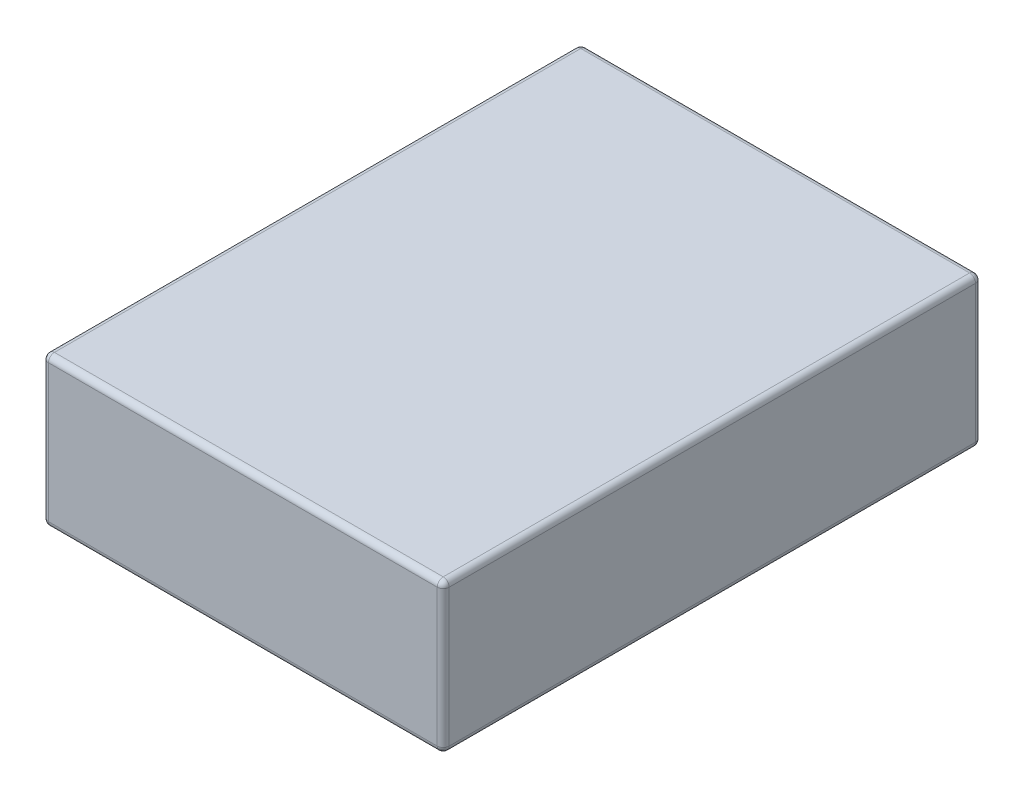
ISO-10303-21;
HEADER;
FILE_DESCRIPTION(('STEP AP214'),'2;1');
FILE_NAME('part.step','',(''),(''),'','','');
FILE_SCHEMA(('AUTOMOTIVE_DESIGN { 1 0 10303 214 1 1 1 1 }'));
ENDSEC;
DATA;
#1=APPLICATION_CONTEXT('core data for automotive mechanical design processes');
#2=APPLICATION_PROTOCOL_DEFINITION('international standard','automotive_design',2000,#1);
#3=PRODUCT_CONTEXT('',#1,'mechanical');
#4=PRODUCT('Part','Part','',(#3));
#5=PRODUCT_RELATED_PRODUCT_CATEGORY('part','',(#4));
#6=PRODUCT_DEFINITION_FORMATION('','',#4);
#7=PRODUCT_DEFINITION_CONTEXT('part definition',#1,'design');
#8=PRODUCT_DEFINITION('design','',#6,#7);
#9=PRODUCT_DEFINITION_SHAPE('','',#8);
#10=(LENGTH_UNIT() NAMED_UNIT(*) SI_UNIT(.MILLI.,.METRE.));
#11=(NAMED_UNIT(*) PLANE_ANGLE_UNIT() SI_UNIT($,.RADIAN.));
#12=(NAMED_UNIT(*) SI_UNIT($,.STERADIAN.) SOLID_ANGLE_UNIT());
#13=UNCERTAINTY_MEASURE_WITH_UNIT(LENGTH_MEASURE(1.E-05),#10,'distance_accuracy_value','');
#14=(GEOMETRIC_REPRESENTATION_CONTEXT(3) GLOBAL_UNCERTAINTY_ASSIGNED_CONTEXT((#13)) GLOBAL_UNIT_ASSIGNED_CONTEXT((#10,
#11,#12)) REPRESENTATION_CONTEXT('',''));
#15=CARTESIAN_POINT('',(0.,0.,0.));
#16=DIRECTION('',(0.,0.,1.));
#17=DIRECTION('',(1.,0.,0.));
#18=AXIS2_PLACEMENT_3D('',#15,#16,#17);
#19=CARTESIAN_POINT('',(33.5,25.,45.));
#20=DIRECTION('',(-1.,0.,0.));
#21=DIRECTION('',(0.,0.,1.));
#22=AXIS2_PLACEMENT_3D('',#19,#20,#21);
#23=PLANE('',#22);
#24=DIRECTION('',(0.,0.,-1.));
#25=VECTOR('',#24,1.);
#26=CARTESIAN_POINT('',(33.5,1.,-45.));
#27=LINE('',#26,#25);
#28=CARTESIAN_POINT('',(33.5,1.,44.));
#29=VERTEX_POINT('',#28);
#30=CARTESIAN_POINT('',(33.5,1.,-44.));
#31=VERTEX_POINT('',#30);
#32=EDGE_CURVE('E245',#29,#31,#27,.T.);
#33=ORIENTED_EDGE('',*,*,#32,.T.);
#34=DIRECTION('',(0.,-1.,0.));
#35=VECTOR('',#34,1.);
#36=CARTESIAN_POINT('',(33.5,25.,-44.));
#37=LINE('',#36,#35);
#38=CARTESIAN_POINT('',(33.5,24.,-44.));
#39=VERTEX_POINT('',#38);
#40=EDGE_CURVE('E240',#31,#39,#37,.F.);
#41=ORIENTED_EDGE('',*,*,#40,.T.);
#42=DIRECTION('',(0.,0.,-1.));
#43=VECTOR('',#42,1.);
#44=CARTESIAN_POINT('',(33.5,24.,45.));
#45=LINE('',#44,#43);
#46=CARTESIAN_POINT('',(33.5,24.,44.));
#47=VERTEX_POINT('',#46);
#48=EDGE_CURVE('E236',#39,#47,#45,.F.);
#49=ORIENTED_EDGE('',*,*,#48,.T.);
#50=DIRECTION('',(0.,-1.,0.));
#51=VECTOR('',#50,1.);
#52=CARTESIAN_POINT('',(33.5,25.,44.));
#53=LINE('',#52,#51);
#54=EDGE_CURVE('E241',#47,#29,#53,.T.);
#55=ORIENTED_EDGE('',*,*,#54,.T.);
#56=EDGE_LOOP('',(#33,#41,#49,#55));
#57=FACE_BOUND('',#56,.T.);
#58=ADVANCED_FACE('F39',(#57),#23,.F.);
#59=CARTESIAN_POINT('',(-33.5,25.,-45.));
#60=DIRECTION('',(0.,0.,1.));
#61=DIRECTION('',(1.,0.,0.));
#62=AXIS2_PLACEMENT_3D('',#59,#60,#61);
#63=PLANE('',#62);
#64=DIRECTION('',(0.,-1.,0.));
#65=VECTOR('',#64,1.);
#66=CARTESIAN_POINT('',(32.5,25.,-45.));
#67=LINE('',#66,#65);
#68=CARTESIAN_POINT('',(32.5,24.,-45.));
#69=VERTEX_POINT('',#68);
#70=CARTESIAN_POINT('',(32.5,1.,-45.));
#71=VERTEX_POINT('',#70);
#72=EDGE_CURVE('E323',#69,#71,#67,.T.);
#73=ORIENTED_EDGE('',*,*,#72,.T.);
#74=DIRECTION('',(-1.,0.,0.));
#75=VECTOR('',#74,1.);
#76=CARTESIAN_POINT('',(-33.5,1.,-45.));
#77=LINE('',#76,#75);
#78=CARTESIAN_POINT('',(-32.5,1.,-45.));
#79=VERTEX_POINT('',#78);
#80=EDGE_CURVE('E326',#71,#79,#77,.T.);
#81=ORIENTED_EDGE('',*,*,#80,.T.);
#82=DIRECTION('',(0.,-1.,0.));
#83=VECTOR('',#82,1.);
#84=CARTESIAN_POINT('',(-32.5,25.,-45.));
#85=LINE('',#84,#83);
#86=CARTESIAN_POINT('',(-32.5,24.,-45.));
#87=VERTEX_POINT('',#86);
#88=EDGE_CURVE('E317',#79,#87,#85,.F.);
#89=ORIENTED_EDGE('',*,*,#88,.T.);
#90=DIRECTION('',(-1.,0.,0.));
#91=VECTOR('',#90,1.);
#92=CARTESIAN_POINT('',(-33.5,24.,-45.));
#93=LINE('',#92,#91);
#94=EDGE_CURVE('E314',#87,#69,#93,.F.);
#95=ORIENTED_EDGE('',*,*,#94,.T.);
#96=EDGE_LOOP('',(#73,#81,#89,#95));
#97=FACE_BOUND('',#96,.T.);
#98=ADVANCED_FACE('F359',(#97),#63,.F.);
#99=CARTESIAN_POINT('',(-33.5,25.,45.));
#100=DIRECTION('',(1.,0.,0.));
#101=DIRECTION('',(0.,0.,-1.));
#102=AXIS2_PLACEMENT_3D('',#99,#100,#101);
#103=PLANE('',#102);
#104=DIRECTION('',(0.,-1.,0.));
#105=VECTOR('',#104,1.);
#106=CARTESIAN_POINT('',(-33.5,25.,-44.));
#107=LINE('',#106,#105);
#108=CARTESIAN_POINT('',(-33.5,24.,-44.));
#109=VERTEX_POINT('',#108);
#110=CARTESIAN_POINT('',(-33.5,1.,-44.));
#111=VERTEX_POINT('',#110);
#112=EDGE_CURVE('E139',#109,#111,#107,.T.);
#113=ORIENTED_EDGE('',*,*,#112,.T.);
#114=DIRECTION('',(0.,0.,1.));
#115=VECTOR('',#114,1.);
#116=CARTESIAN_POINT('',(-33.5,1.,45.));
#117=LINE('',#116,#115);
#118=CARTESIAN_POINT('',(-33.5,1.,44.));
#119=VERTEX_POINT('',#118);
#120=EDGE_CURVE('E134',#111,#119,#117,.T.);
#121=ORIENTED_EDGE('',*,*,#120,.T.);
#122=DIRECTION('',(0.,-1.,0.));
#123=VECTOR('',#122,1.);
#124=CARTESIAN_POINT('',(-33.5,25.,44.));
#125=LINE('',#124,#123);
#126=CARTESIAN_POINT('',(-33.5,24.,44.));
#127=VERTEX_POINT('',#126);
#128=EDGE_CURVE('E128',#119,#127,#125,.F.);
#129=ORIENTED_EDGE('',*,*,#128,.T.);
#130=DIRECTION('',(0.,0.,1.));
#131=VECTOR('',#130,1.);
#132=CARTESIAN_POINT('',(-33.5,24.,45.));
#133=LINE('',#132,#131);
#134=EDGE_CURVE('E131',#127,#109,#133,.F.);
#135=ORIENTED_EDGE('',*,*,#134,.T.);
#136=EDGE_LOOP('',(#113,#121,#129,#135));
#137=FACE_BOUND('',#136,.T.);
#138=ADVANCED_FACE('F130',(#137),#103,.F.);
#139=CARTESIAN_POINT('',(-33.5,25.,45.));
#140=DIRECTION('',(0.,0.,-1.));
#141=DIRECTION('',(-1.,0.,0.));
#142=AXIS2_PLACEMENT_3D('',#139,#140,#141);
#143=PLANE('',#142);
#144=DIRECTION('',(1.,0.,0.));
#145=VECTOR('',#144,1.);
#146=CARTESIAN_POINT('',(-33.5,24.,45.));
#147=LINE('',#146,#145);
#148=CARTESIAN_POINT('',(32.5,24.,45.));
#149=VERTEX_POINT('',#148);
#150=CARTESIAN_POINT('',(-32.5,24.,45.));
#151=VERTEX_POINT('',#150);
#152=EDGE_CURVE('E259',#149,#151,#147,.F.);
#153=ORIENTED_EDGE('',*,*,#152,.T.);
#154=DIRECTION('',(0.,-1.,0.));
#155=VECTOR('',#154,1.);
#156=CARTESIAN_POINT('',(-32.5,25.,45.));
#157=LINE('',#156,#155);
#158=CARTESIAN_POINT('',(-32.5,1.,45.));
#159=VERTEX_POINT('',#158);
#160=EDGE_CURVE('E163',#151,#159,#157,.T.);
#161=ORIENTED_EDGE('',*,*,#160,.T.);
#162=DIRECTION('',(1.,0.,0.));
#163=VECTOR('',#162,1.);
#164=CARTESIAN_POINT('',(33.5,1.,45.));
#165=LINE('',#164,#163);
#166=CARTESIAN_POINT('',(32.5,1.,45.));
#167=VERTEX_POINT('',#166);
#168=EDGE_CURVE('E250',#159,#167,#165,.T.);
#169=ORIENTED_EDGE('',*,*,#168,.T.);
#170=DIRECTION('',(0.,-1.,0.));
#171=VECTOR('',#170,1.);
#172=CARTESIAN_POINT('',(32.5,25.,45.));
#173=LINE('',#172,#171);
#174=EDGE_CURVE('E253',#167,#149,#173,.F.);
#175=ORIENTED_EDGE('',*,*,#174,.T.);
#176=EDGE_LOOP('',(#153,#161,#169,#175));
#177=FACE_BOUND('',#176,.T.);
#178=ADVANCED_FACE('F543',(#177),#143,.F.);
#179=CARTESIAN_POINT('',(0.,25.,0.));
#180=DIRECTION('',(0.,-1.,0.));
#181=DIRECTION('',(0.,0.,-1.));
#182=AXIS2_PLACEMENT_3D('',#179,#180,#181);
#183=PLANE('',#182);
#184=DIRECTION('',(1.,0.,0.));
#185=VECTOR('',#184,1.);
#186=CARTESIAN_POINT('',(0.,25.,44.));
#187=LINE('',#186,#185);
#188=CARTESIAN_POINT('',(-32.5,25.,44.));
#189=VERTEX_POINT('',#188);
#190=CARTESIAN_POINT('',(32.5,25.,44.));
#191=VERTEX_POINT('',#190);
#192=EDGE_CURVE('E49',#189,#191,#187,.T.);
#193=ORIENTED_EDGE('',*,*,#192,.T.);
#194=DIRECTION('',(0.,0.,-1.));
#195=VECTOR('',#194,1.);
#196=CARTESIAN_POINT('',(32.5,25.,0.));
#197=LINE('',#196,#195);
#198=CARTESIAN_POINT('',(32.5,25.,-44.));
#199=VERTEX_POINT('',#198);
#200=EDGE_CURVE('E11',#191,#199,#197,.T.);
#201=ORIENTED_EDGE('',*,*,#200,.T.);
#202=DIRECTION('',(-1.,0.,0.));
#203=VECTOR('',#202,1.);
#204=CARTESIAN_POINT('',(0.,25.,-44.));
#205=LINE('',#204,#203);
#206=CARTESIAN_POINT('',(-32.5,25.,-44.));
#207=VERTEX_POINT('',#206);
#208=EDGE_CURVE('E264',#199,#207,#205,.T.);
#209=ORIENTED_EDGE('',*,*,#208,.T.);
#210=DIRECTION('',(0.,0.,1.));
#211=VECTOR('',#210,1.);
#212=CARTESIAN_POINT('',(-32.5,25.,0.));
#213=LINE('',#212,#211);
#214=EDGE_CURVE('E60',#207,#189,#213,.T.);
#215=ORIENTED_EDGE('',*,*,#214,.T.);
#216=EDGE_LOOP('',(#193,#201,#209,#215));
#217=FACE_BOUND('',#216,.T.);
#218=ADVANCED_FACE('F535',(#217),#183,.F.);
#219=CARTESIAN_POINT('',(0.,0.,0.));
#220=DIRECTION('',(0.,-1.,0.));
#221=DIRECTION('',(0.,0.,-1.));
#222=AXIS2_PLACEMENT_3D('',#219,#220,#221);
#223=PLANE('',#222);
#224=DIRECTION('',(1.,0.,0.));
#225=VECTOR('',#224,1.);
#226=CARTESIAN_POINT('',(-33.5,0.,44.));
#227=LINE('',#226,#225);
#228=CARTESIAN_POINT('',(32.5,0.,44.));
#229=VERTEX_POINT('',#228);
#230=CARTESIAN_POINT('',(-32.5,0.,44.));
#231=VERTEX_POINT('',#230);
#232=EDGE_CURVE('E305',#229,#231,#227,.F.);
#233=ORIENTED_EDGE('',*,*,#232,.T.);
#234=DIRECTION('',(0.,0.,1.));
#235=VECTOR('',#234,1.);
#236=CARTESIAN_POINT('',(-32.5,0.,-45.));
#237=LINE('',#236,#235);
#238=CARTESIAN_POINT('',(-32.5,0.,-44.));
#239=VERTEX_POINT('',#238);
#240=EDGE_CURVE('E304',#231,#239,#237,.F.);
#241=ORIENTED_EDGE('',*,*,#240,.T.);
#242=DIRECTION('',(-1.,0.,0.));
#243=VECTOR('',#242,1.);
#244=CARTESIAN_POINT('',(33.5,0.,-44.));
#245=LINE('',#244,#243);
#246=CARTESIAN_POINT('',(32.5,0.,-44.));
#247=VERTEX_POINT('',#246);
#248=EDGE_CURVE('E297',#239,#247,#245,.F.);
#249=ORIENTED_EDGE('',*,*,#248,.T.);
#250=DIRECTION('',(0.,0.,-1.));
#251=VECTOR('',#250,1.);
#252=CARTESIAN_POINT('',(32.5,0.,45.));
#253=LINE('',#252,#251);
#254=EDGE_CURVE('E347',#247,#229,#253,.F.);
#255=ORIENTED_EDGE('',*,*,#254,.T.);
#256=EDGE_LOOP('',(#233,#241,#249,#255));
#257=FACE_BOUND('',#256,.T.);
#258=ADVANCED_FACE('F308',(#257),#223,.T.);
#259=CARTESIAN_POINT('',(32.5,24.,0.));
#260=DIRECTION('',(0.,0.,-1.));
#261=DIRECTION('',(-1.,0.,0.));
#262=AXIS2_PLACEMENT_3D('',#259,#260,#261);
#263=CYLINDRICAL_SURFACE('',#262,1.);
#264=CARTESIAN_POINT('',(32.5,24.,-44.));
#265=DIRECTION('',(0.,0.,-1.));
#266=DIRECTION('',(-1.,0.,0.));
#267=AXIS2_PLACEMENT_3D('',#264,#265,#266);
#268=CIRCLE('',#267,1.);
#269=EDGE_CURVE('E43',#199,#39,#268,.T.);
#270=ORIENTED_EDGE('',*,*,#269,.F.);
#271=ORIENTED_EDGE('',*,*,#200,.F.);
#272=CARTESIAN_POINT('',(32.5,24.,44.));
#273=DIRECTION('',(0.,0.,1.));
#274=DIRECTION('',(1.,0.,0.));
#275=AXIS2_PLACEMENT_3D('',#272,#273,#274);
#276=CIRCLE('',#275,1.);
#277=EDGE_CURVE('E219',#47,#191,#276,.T.);
#278=ORIENTED_EDGE('',*,*,#277,.F.);
#279=ORIENTED_EDGE('',*,*,#48,.F.);
#280=EDGE_LOOP('',(#270,#271,#278,#279));
#281=FACE_BOUND('',#280,.T.);
#282=ADVANCED_FACE('F41',(#281),#263,.T.);
#283=CARTESIAN_POINT('',(32.5,24.,-44.));
#284=DIRECTION('',(0.,0.,1.));
#285=DIRECTION('',(1.,0.,0.));
#286=AXIS2_PLACEMENT_3D('',#283,#284,#285);
#287=SPHERICAL_SURFACE('',#286,1.);
#288=CARTESIAN_POINT('',(32.5,24.,-44.));
#289=DIRECTION('',(1.,0.,0.));
#290=DIRECTION('',(0.,0.,-1.));
#291=AXIS2_PLACEMENT_3D('',#288,#289,#290);
#292=CIRCLE('',#291,1.);
#293=EDGE_CURVE('E213',#199,#69,#292,.F.);
#294=ORIENTED_EDGE('',*,*,#293,.F.);
#295=ORIENTED_EDGE('',*,*,#269,.T.);
#296=CARTESIAN_POINT('',(32.5,24.,-44.));
#297=DIRECTION('',(0.,1.,0.));
#298=DIRECTION('',(0.,0.,1.));
#299=AXIS2_PLACEMENT_3D('',#296,#297,#298);
#300=CIRCLE('',#299,1.);
#301=EDGE_CURVE('E217',#69,#39,#300,.F.);
#302=ORIENTED_EDGE('',*,*,#301,.F.);
#303=EDGE_LOOP('',(#294,#295,#302));
#304=FACE_BOUND('',#303,.T.);
#305=ADVANCED_FACE('F233',(#304),#287,.T.);
#306=CARTESIAN_POINT('',(32.5,24.,44.));
#307=DIRECTION('',(0.,0.,1.));
#308=DIRECTION('',(1.,0.,0.));
#309=AXIS2_PLACEMENT_3D('',#306,#307,#308);
#310=SPHERICAL_SURFACE('',#309,1.);
#311=CARTESIAN_POINT('',(32.5,24.,44.));
#312=DIRECTION('',(0.,1.,0.));
#313=DIRECTION('',(0.,0.,1.));
#314=AXIS2_PLACEMENT_3D('',#311,#312,#313);
#315=CIRCLE('',#314,1.);
#316=EDGE_CURVE('E205',#47,#149,#315,.F.);
#317=ORIENTED_EDGE('',*,*,#316,.F.);
#318=ORIENTED_EDGE('',*,*,#277,.T.);
#319=CARTESIAN_POINT('',(32.5,24.,44.));
#320=DIRECTION('',(1.,0.,0.));
#321=DIRECTION('',(0.,0.,-1.));
#322=AXIS2_PLACEMENT_3D('',#319,#320,#321);
#323=CIRCLE('',#322,1.);
#324=EDGE_CURVE('E209',#149,#191,#323,.F.);
#325=ORIENTED_EDGE('',*,*,#324,.F.);
#326=EDGE_LOOP('',(#317,#318,#325));
#327=FACE_BOUND('',#326,.T.);
#328=ADVANCED_FACE('F508',(#327),#310,.T.);
#329=CARTESIAN_POINT('',(32.5,25.,-44.));
#330=DIRECTION('',(0.,-1.,0.));
#331=DIRECTION('',(0.,0.,-1.));
#332=AXIS2_PLACEMENT_3D('',#329,#330,#331);
#333=CYLINDRICAL_SURFACE('',#332,1.);
#334=ORIENTED_EDGE('',*,*,#301,.T.);
#335=ORIENTED_EDGE('',*,*,#40,.F.);
#336=CARTESIAN_POINT('',(32.5,1.,-44.));
#337=DIRECTION('',(0.,-1.,0.));
#338=DIRECTION('',(0.,0.,-1.));
#339=AXIS2_PLACEMENT_3D('',#336,#337,#338);
#340=CIRCLE('',#339,1.);
#341=EDGE_CURVE('E197',#71,#31,#340,.T.);
#342=ORIENTED_EDGE('',*,*,#341,.F.);
#343=ORIENTED_EDGE('',*,*,#72,.F.);
#344=EDGE_LOOP('',(#334,#335,#342,#343));
#345=FACE_BOUND('',#344,.T.);
#346=ADVANCED_FACE('F360',(#345),#333,.T.);
#347=CARTESIAN_POINT('',(0.,24.,-44.));
#348=DIRECTION('',(-1.,0.,0.));
#349=DIRECTION('',(0.,0.,1.));
#350=AXIS2_PLACEMENT_3D('',#347,#348,#349);
#351=CYLINDRICAL_SURFACE('',#350,1.);
#352=ORIENTED_EDGE('',*,*,#293,.T.);
#353=ORIENTED_EDGE('',*,*,#94,.F.);
#354=CARTESIAN_POINT('',(-32.5,24.,-44.));
#355=DIRECTION('',(-1.,0.,0.));
#356=DIRECTION('',(0.,0.,1.));
#357=AXIS2_PLACEMENT_3D('',#354,#355,#356);
#358=CIRCLE('',#357,1.);
#359=EDGE_CURVE('E193',#207,#87,#358,.T.);
#360=ORIENTED_EDGE('',*,*,#359,.F.);
#361=ORIENTED_EDGE('',*,*,#208,.F.);
#362=EDGE_LOOP('',(#352,#353,#360,#361));
#363=FACE_BOUND('',#362,.T.);
#364=ADVANCED_FACE('F492',(#363),#351,.T.);
#365=CARTESIAN_POINT('',(-32.5,24.,0.));
#366=DIRECTION('',(0.,0.,1.));
#367=DIRECTION('',(1.,0.,0.));
#368=AXIS2_PLACEMENT_3D('',#365,#366,#367);
#369=CYLINDRICAL_SURFACE('',#368,1.);
#370=CARTESIAN_POINT('',(-32.5,24.,44.));
#371=DIRECTION('',(0.,0.,1.));
#372=DIRECTION('',(1.,0.,0.));
#373=AXIS2_PLACEMENT_3D('',#370,#371,#372);
#374=CIRCLE('',#373,1.);
#375=EDGE_CURVE('E145',#189,#127,#374,.T.);
#376=ORIENTED_EDGE('',*,*,#375,.F.);
#377=ORIENTED_EDGE('',*,*,#214,.F.);
#378=CARTESIAN_POINT('',(-32.5,24.,-44.));
#379=DIRECTION('',(0.,0.,-1.));
#380=DIRECTION('',(-1.,0.,0.));
#381=AXIS2_PLACEMENT_3D('',#378,#379,#380);
#382=CIRCLE('',#381,1.);
#383=EDGE_CURVE('E148',#109,#207,#382,.T.);
#384=ORIENTED_EDGE('',*,*,#383,.F.);
#385=ORIENTED_EDGE('',*,*,#134,.F.);
#386=EDGE_LOOP('',(#376,#377,#384,#385));
#387=FACE_BOUND('',#386,.T.);
#388=ADVANCED_FACE('F144',(#387),#369,.T.);
#389=CARTESIAN_POINT('',(0.,24.,44.));
#390=DIRECTION('',(1.,0.,0.));
#391=DIRECTION('',(0.,0.,-1.));
#392=AXIS2_PLACEMENT_3D('',#389,#390,#391);
#393=CYLINDRICAL_SURFACE('',#392,1.);
#394=ORIENTED_EDGE('',*,*,#324,.T.);
#395=ORIENTED_EDGE('',*,*,#192,.F.);
#396=CARTESIAN_POINT('',(-32.5,24.,44.));
#397=DIRECTION('',(-1.,0.,0.));
#398=DIRECTION('',(0.,0.,1.));
#399=AXIS2_PLACEMENT_3D('',#396,#397,#398);
#400=CIRCLE('',#399,1.);
#401=EDGE_CURVE('E158',#151,#189,#400,.T.);
#402=ORIENTED_EDGE('',*,*,#401,.F.);
#403=ORIENTED_EDGE('',*,*,#152,.F.);
#404=EDGE_LOOP('',(#394,#395,#402,#403));
#405=FACE_BOUND('',#404,.T.);
#406=ADVANCED_FACE('F476',(#405),#393,.T.);
#407=CARTESIAN_POINT('',(32.5,25.,44.));
#408=DIRECTION('',(0.,-1.,0.));
#409=DIRECTION('',(0.,0.,-1.));
#410=AXIS2_PLACEMENT_3D('',#407,#408,#409);
#411=CYLINDRICAL_SURFACE('',#410,1.);
#412=ORIENTED_EDGE('',*,*,#316,.T.);
#413=ORIENTED_EDGE('',*,*,#174,.F.);
#414=CARTESIAN_POINT('',(32.5,1.,44.));
#415=DIRECTION('',(0.,-1.,0.));
#416=DIRECTION('',(0.,0.,-1.));
#417=AXIS2_PLACEMENT_3D('',#414,#415,#416);
#418=CIRCLE('',#417,1.);
#419=EDGE_CURVE('E185',#29,#167,#418,.T.);
#420=ORIENTED_EDGE('',*,*,#419,.F.);
#421=ORIENTED_EDGE('',*,*,#54,.F.);
#422=EDGE_LOOP('',(#412,#413,#420,#421));
#423=FACE_BOUND('',#422,.T.);
#424=ADVANCED_FACE('F340',(#423),#411,.T.);
#425=CARTESIAN_POINT('',(32.5,1.,45.));
#426=DIRECTION('',(0.,0.,1.));
#427=DIRECTION('',(1.,0.,0.));
#428=AXIS2_PLACEMENT_3D('',#425,#426,#427);
#429=CYLINDRICAL_SURFACE('',#428,1.);
#430=CARTESIAN_POINT('',(32.5,1.,-44.));
#431=DIRECTION('',(0.,0.,-1.));
#432=DIRECTION('',(-1.,0.,0.));
#433=AXIS2_PLACEMENT_3D('',#430,#431,#432);
#434=CIRCLE('',#433,1.);
#435=EDGE_CURVE('E201',#31,#247,#434,.T.);
#436=ORIENTED_EDGE('',*,*,#435,.F.);
#437=ORIENTED_EDGE('',*,*,#32,.F.);
#438=CARTESIAN_POINT('',(32.5,1.,44.));
#439=DIRECTION('',(0.,0.,1.));
#440=DIRECTION('',(1.,0.,0.));
#441=AXIS2_PLACEMENT_3D('',#438,#439,#440);
#442=CIRCLE('',#441,1.);
#443=EDGE_CURVE('E181',#229,#29,#442,.T.);
#444=ORIENTED_EDGE('',*,*,#443,.F.);
#445=ORIENTED_EDGE('',*,*,#254,.F.);
#446=EDGE_LOOP('',(#436,#437,#444,#445));
#447=FACE_BOUND('',#446,.T.);
#448=ADVANCED_FACE('F337',(#447),#429,.T.);
#449=CARTESIAN_POINT('',(32.5,1.,-44.));
#450=DIRECTION('',(0.,0.,1.));
#451=DIRECTION('',(1.,0.,0.));
#452=AXIS2_PLACEMENT_3D('',#449,#450,#451);
#453=SPHERICAL_SURFACE('',#452,1.);
#454=ORIENTED_EDGE('',*,*,#341,.T.);
#455=ORIENTED_EDGE('',*,*,#435,.T.);
#456=CARTESIAN_POINT('',(32.5,1.,-44.));
#457=DIRECTION('',(1.,0.,0.));
#458=DIRECTION('',(0.,0.,-1.));
#459=AXIS2_PLACEMENT_3D('',#456,#457,#458);
#460=CIRCLE('',#459,1.);
#461=EDGE_CURVE('E171',#71,#247,#460,.F.);
#462=ORIENTED_EDGE('',*,*,#461,.F.);
#463=EDGE_LOOP('',(#454,#455,#462));
#464=FACE_BOUND('',#463,.T.);
#465=ADVANCED_FACE('F362',(#464),#453,.T.);
#466=CARTESIAN_POINT('',(-32.5,24.,-44.));
#467=DIRECTION('',(0.,0.,1.));
#468=DIRECTION('',(1.,0.,0.));
#469=AXIS2_PLACEMENT_3D('',#466,#467,#468);
#470=SPHERICAL_SURFACE('',#469,1.);
#471=ORIENTED_EDGE('',*,*,#383,.T.);
#472=ORIENTED_EDGE('',*,*,#359,.T.);
#473=CARTESIAN_POINT('',(-32.5,24.,-44.));
#474=DIRECTION('',(0.,1.,0.));
#475=DIRECTION('',(0.,0.,1.));
#476=AXIS2_PLACEMENT_3D('',#473,#474,#475);
#477=CIRCLE('',#476,1.);
#478=EDGE_CURVE('E165',#109,#87,#477,.F.);
#479=ORIENTED_EDGE('',*,*,#478,.F.);
#480=EDGE_LOOP('',(#471,#472,#479));
#481=FACE_BOUND('',#480,.T.);
#482=ADVANCED_FACE('F364',(#481),#470,.T.);
#483=CARTESIAN_POINT('',(-32.5,24.,44.));
#484=DIRECTION('',(0.,0.,1.));
#485=DIRECTION('',(1.,0.,0.));
#486=AXIS2_PLACEMENT_3D('',#483,#484,#485);
#487=SPHERICAL_SURFACE('',#486,1.);
#488=ORIENTED_EDGE('',*,*,#401,.T.);
#489=ORIENTED_EDGE('',*,*,#375,.T.);
#490=CARTESIAN_POINT('',(-32.5,24.,44.));
#491=DIRECTION('',(0.,1.,0.));
#492=DIRECTION('',(0.,0.,1.));
#493=AXIS2_PLACEMENT_3D('',#490,#491,#492);
#494=CIRCLE('',#493,1.);
#495=EDGE_CURVE('E155',#151,#127,#494,.F.);
#496=ORIENTED_EDGE('',*,*,#495,.F.);
#497=EDGE_LOOP('',(#488,#489,#496));
#498=FACE_BOUND('',#497,.T.);
#499=ADVANCED_FACE('F154',(#498),#487,.T.);
#500=CARTESIAN_POINT('',(32.5,1.,44.));
#501=DIRECTION('',(0.,0.,1.));
#502=DIRECTION('',(1.,0.,0.));
#503=AXIS2_PLACEMENT_3D('',#500,#501,#502);
#504=SPHERICAL_SURFACE('',#503,1.);
#505=ORIENTED_EDGE('',*,*,#443,.T.);
#506=ORIENTED_EDGE('',*,*,#419,.T.);
#507=CARTESIAN_POINT('',(32.5,1.,44.));
#508=DIRECTION('',(1.,0.,0.));
#509=DIRECTION('',(0.,0.,-1.));
#510=AXIS2_PLACEMENT_3D('',#507,#508,#509);
#511=CIRCLE('',#510,1.);
#512=EDGE_CURVE('E166',#229,#167,#511,.F.);
#513=ORIENTED_EDGE('',*,*,#512,.F.);
#514=EDGE_LOOP('',(#505,#506,#513));
#515=FACE_BOUND('',#514,.T.);
#516=ADVANCED_FACE('F342',(#515),#504,.T.);
#517=CARTESIAN_POINT('',(-33.5,1.,-44.));
#518=DIRECTION('',(1.,0.,0.));
#519=DIRECTION('',(0.,0.,-1.));
#520=AXIS2_PLACEMENT_3D('',#517,#518,#519);
#521=CYLINDRICAL_SURFACE('',#520,1.);
#522=ORIENTED_EDGE('',*,*,#461,.T.);
#523=ORIENTED_EDGE('',*,*,#248,.F.);
#524=CARTESIAN_POINT('',(-32.5,1.,-44.));
#525=DIRECTION('',(-1.,0.,0.));
#526=DIRECTION('',(0.,0.,1.));
#527=AXIS2_PLACEMENT_3D('',#524,#525,#526);
#528=CIRCLE('',#527,1.);
#529=EDGE_CURVE('E174',#79,#239,#528,.T.);
#530=ORIENTED_EDGE('',*,*,#529,.F.);
#531=ORIENTED_EDGE('',*,*,#80,.F.);
#532=EDGE_LOOP('',(#522,#523,#530,#531));
#533=FACE_BOUND('',#532,.T.);
#534=ADVANCED_FACE('F299',(#533),#521,.T.);
#535=CARTESIAN_POINT('',(-32.5,25.,-44.));
#536=DIRECTION('',(0.,-1.,0.));
#537=DIRECTION('',(0.,0.,-1.));
#538=AXIS2_PLACEMENT_3D('',#535,#536,#537);
#539=CYLINDRICAL_SURFACE('',#538,1.);
#540=ORIENTED_EDGE('',*,*,#478,.T.);
#541=ORIENTED_EDGE('',*,*,#88,.F.);
#542=CARTESIAN_POINT('',(-32.5,1.,-44.));
#543=DIRECTION('',(0.,-1.,0.));
#544=DIRECTION('',(0.,0.,-1.));
#545=AXIS2_PLACEMENT_3D('',#542,#543,#544);
#546=CIRCLE('',#545,1.);
#547=EDGE_CURVE('E284',#111,#79,#546,.T.);
#548=ORIENTED_EDGE('',*,*,#547,.F.);
#549=ORIENTED_EDGE('',*,*,#112,.F.);
#550=EDGE_LOOP('',(#540,#541,#548,#549));
#551=FACE_BOUND('',#550,.T.);
#552=ADVANCED_FACE('F356',(#551),#539,.T.);
#553=CARTESIAN_POINT('',(-32.5,25.,44.));
#554=DIRECTION('',(0.,-1.,0.));
#555=DIRECTION('',(0.,0.,-1.));
#556=AXIS2_PLACEMENT_3D('',#553,#554,#555);
#557=CYLINDRICAL_SURFACE('',#556,1.);
#558=ORIENTED_EDGE('',*,*,#495,.T.);
#559=ORIENTED_EDGE('',*,*,#128,.F.);
#560=CARTESIAN_POINT('',(-32.5,1.,44.));
#561=DIRECTION('',(0.,-1.,0.));
#562=DIRECTION('',(0.,0.,-1.));
#563=AXIS2_PLACEMENT_3D('',#560,#561,#562);
#564=CIRCLE('',#563,1.);
#565=EDGE_CURVE('E280',#159,#119,#564,.T.);
#566=ORIENTED_EDGE('',*,*,#565,.F.);
#567=ORIENTED_EDGE('',*,*,#160,.F.);
#568=EDGE_LOOP('',(#558,#559,#566,#567));
#569=FACE_BOUND('',#568,.T.);
#570=ADVANCED_FACE('F161',(#569),#557,.T.);
#571=CARTESIAN_POINT('',(-33.5,1.,44.));
#572=DIRECTION('',(-1.,0.,0.));
#573=DIRECTION('',(0.,0.,1.));
#574=AXIS2_PLACEMENT_3D('',#571,#572,#573);
#575=CYLINDRICAL_SURFACE('',#574,1.);
#576=ORIENTED_EDGE('',*,*,#512,.T.);
#577=ORIENTED_EDGE('',*,*,#168,.F.);
#578=CARTESIAN_POINT('',(-32.5,1.,44.));
#579=DIRECTION('',(-1.,0.,0.));
#580=DIRECTION('',(0.,0.,1.));
#581=AXIS2_PLACEMENT_3D('',#578,#579,#580);
#582=CIRCLE('',#581,1.);
#583=EDGE_CURVE('E277',#231,#159,#582,.T.);
#584=ORIENTED_EDGE('',*,*,#583,.F.);
#585=ORIENTED_EDGE('',*,*,#232,.F.);
#586=EDGE_LOOP('',(#576,#577,#584,#585));
#587=FACE_BOUND('',#586,.T.);
#588=ADVANCED_FACE('F345',(#587),#575,.T.);
#589=CARTESIAN_POINT('',(-32.5,1.,-44.));
#590=DIRECTION('',(0.,0.,1.));
#591=DIRECTION('',(1.,0.,0.));
#592=AXIS2_PLACEMENT_3D('',#589,#590,#591);
#593=SPHERICAL_SURFACE('',#592,1.);
#594=ORIENTED_EDGE('',*,*,#547,.T.);
#595=ORIENTED_EDGE('',*,*,#529,.T.);
#596=CARTESIAN_POINT('',(-32.5,1.,-44.));
#597=DIRECTION('',(0.,0.,-1.));
#598=DIRECTION('',(-1.,0.,0.));
#599=AXIS2_PLACEMENT_3D('',#596,#597,#598);
#600=CIRCLE('',#599,1.);
#601=EDGE_CURVE('E274',#111,#239,#600,.F.);
#602=ORIENTED_EDGE('',*,*,#601,.F.);
#603=EDGE_LOOP('',(#594,#595,#602));
#604=FACE_BOUND('',#603,.T.);
#605=ADVANCED_FACE('F292',(#604),#593,.T.);
#606=CARTESIAN_POINT('',(-32.5,1.,44.));
#607=DIRECTION('',(0.,0.,1.));
#608=DIRECTION('',(1.,0.,0.));
#609=AXIS2_PLACEMENT_3D('',#606,#607,#608);
#610=SPHERICAL_SURFACE('',#609,1.);
#611=ORIENTED_EDGE('',*,*,#583,.T.);
#612=ORIENTED_EDGE('',*,*,#565,.T.);
#613=CARTESIAN_POINT('',(-32.5,1.,44.));
#614=DIRECTION('',(0.,0.,1.));
#615=DIRECTION('',(1.,0.,0.));
#616=AXIS2_PLACEMENT_3D('',#613,#614,#615);
#617=CIRCLE('',#616,1.);
#618=EDGE_CURVE('E271',#231,#119,#617,.F.);
#619=ORIENTED_EDGE('',*,*,#618,.F.);
#620=EDGE_LOOP('',(#611,#612,#619));
#621=FACE_BOUND('',#620,.T.);
#622=ADVANCED_FACE('F384',(#621),#610,.T.);
#623=CARTESIAN_POINT('',(-32.5,1.,45.));
#624=DIRECTION('',(0.,0.,-1.));
#625=DIRECTION('',(-1.,0.,0.));
#626=AXIS2_PLACEMENT_3D('',#623,#624,#625);
#627=CYLINDRICAL_SURFACE('',#626,1.);
#628=ORIENTED_EDGE('',*,*,#601,.T.);
#629=ORIENTED_EDGE('',*,*,#240,.F.);
#630=ORIENTED_EDGE('',*,*,#618,.T.);
#631=ORIENTED_EDGE('',*,*,#120,.F.);
#632=EDGE_LOOP('',(#628,#629,#630,#631));
#633=FACE_BOUND('',#632,.T.);
#634=ADVANCED_FACE('F381',(#633),#627,.T.);
#635=CLOSED_SHELL('',(#58,#98,#138,#178,#218,#258,#282,#305,#328,#346,#364,#388,#406,#424,#448,
#465,#482,#499,#516,#534,#552,#570,#588,#605,#622,#634));
#636=MANIFOLD_SOLID_BREP('B2',#635);
#637=ADVANCED_BREP_SHAPE_REPRESENTATION('',(#18,#636),#14);
#638=SHAPE_DEFINITION_REPRESENTATION(#9,#637);
ENDSEC;
END-ISO-10303-21;
